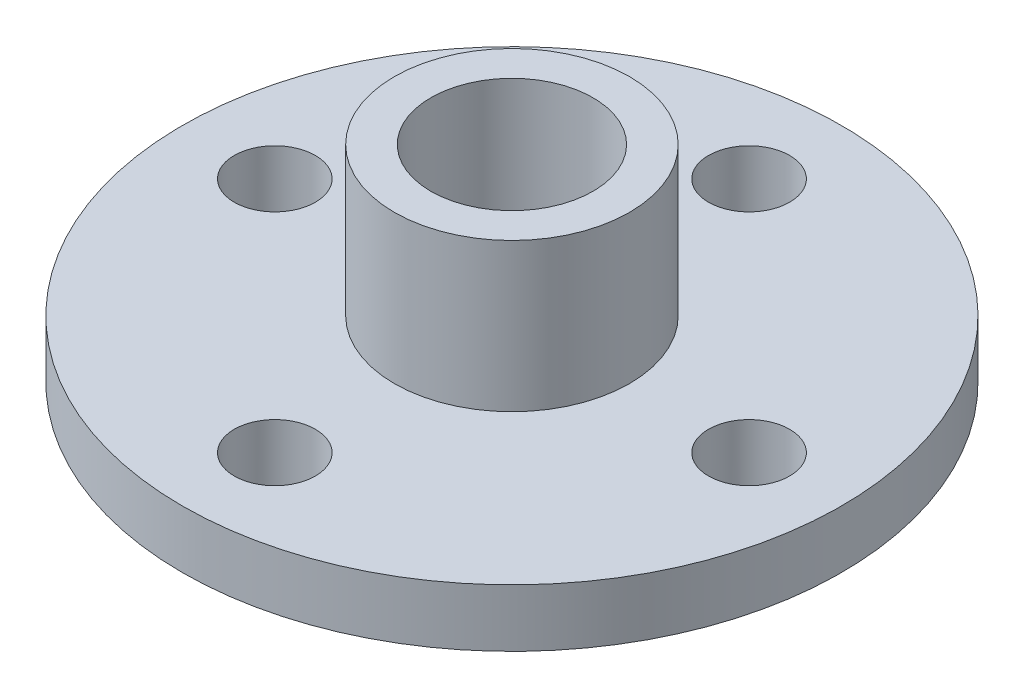
ISO-10303-21;
HEADER;
FILE_DESCRIPTION(('STEP AP214'),'2;1');
FILE_NAME('part.step','',(''),(''),'','','');
FILE_SCHEMA(('AUTOMOTIVE_DESIGN { 1 0 10303 214 1 1 1 1 }'));
ENDSEC;
DATA;
#1=APPLICATION_CONTEXT('core data for automotive mechanical design processes');
#2=APPLICATION_PROTOCOL_DEFINITION('international standard','automotive_design',2000,#1);
#3=PRODUCT_CONTEXT('',#1,'mechanical');
#4=PRODUCT('Part','Part','',(#3));
#5=PRODUCT_RELATED_PRODUCT_CATEGORY('part','',(#4));
#6=PRODUCT_DEFINITION_FORMATION('','',#4);
#7=PRODUCT_DEFINITION_CONTEXT('part definition',#1,'design');
#8=PRODUCT_DEFINITION('design','',#6,#7);
#9=PRODUCT_DEFINITION_SHAPE('','',#8);
#10=(LENGTH_UNIT() NAMED_UNIT(*) SI_UNIT(.MILLI.,.METRE.));
#11=(NAMED_UNIT(*) PLANE_ANGLE_UNIT() SI_UNIT($,.RADIAN.));
#12=(NAMED_UNIT(*) SI_UNIT($,.STERADIAN.) SOLID_ANGLE_UNIT());
#13=UNCERTAINTY_MEASURE_WITH_UNIT(LENGTH_MEASURE(1.E-05),#10,'distance_accuracy_value','');
#14=(GEOMETRIC_REPRESENTATION_CONTEXT(3) GLOBAL_UNCERTAINTY_ASSIGNED_CONTEXT((#13)) GLOBAL_UNIT_ASSIGNED_CONTEXT((#10,
#11,#12)) REPRESENTATION_CONTEXT('',''));
#15=CARTESIAN_POINT('',(0.,0.,0.));
#16=DIRECTION('',(0.,0.,1.));
#17=DIRECTION('',(1.,0.,0.));
#18=AXIS2_PLACEMENT_3D('',#15,#16,#17);
#19=CARTESIAN_POINT('',(0.,1.778,0.));
#20=DIRECTION('',(0.,1.,0.));
#21=DIRECTION('',(0.,0.,1.));
#22=AXIS2_PLACEMENT_3D('',#19,#20,#21);
#23=PLANE('',#22);
#24=CARTESIAN_POINT('',(0.,1.778,0.));
#25=DIRECTION('',(0.,1.,0.));
#26=DIRECTION('',(0.,0.,1.));
#27=AXIS2_PLACEMENT_3D('',#24,#25,#26);
#28=CIRCLE('',#27,1.625);
#29=CARTESIAN_POINT('',(0.,1.778,1.625));
#30=VERTEX_POINT('',#29);
#31=EDGE_CURVE('E62',#30,#30,#28,.T.);
#32=ORIENTED_EDGE('',*,*,#31,.F.);
#33=EDGE_LOOP('',(#32));
#34=FACE_BOUND('',#33,.T.);
#35=CARTESIAN_POINT('',(0.,1.778,0.));
#36=DIRECTION('',(0.,1.,0.));
#37=DIRECTION('',(0.,0.,1.));
#38=AXIS2_PLACEMENT_3D('',#35,#36,#37);
#39=CIRCLE('',#38,2.5);
#40=CARTESIAN_POINT('',(0.,1.778,2.5));
#41=VERTEX_POINT('',#40);
#42=EDGE_CURVE('E12',#41,#41,#39,.F.);
#43=ORIENTED_EDGE('',*,*,#42,.F.);
#44=EDGE_LOOP('',(#43));
#45=FACE_BOUND('',#44,.T.);
#46=ADVANCED_FACE('F46',(#34,#45),#23,.T.);
#47=CARTESIAN_POINT('',(-7.31,1.778,0.));
#48=DIRECTION('',(0.,1.,0.));
#49=DIRECTION('',(0.,0.,1.));
#50=AXIS2_PLACEMENT_3D('',#47,#48,#49);
#51=CIRCLE('',#50,1.25);
#52=CARTESIAN_POINT('',(-7.31,1.778,1.25));
#53=VERTEX_POINT('',#52);
#54=EDGE_CURVE('E78',#53,#53,#51,.T.);
#55=ORIENTED_EDGE('',*,*,#54,.F.);
#56=EDGE_LOOP('',(#55));
#57=FACE_BOUND('',#56,.T.);
#58=CARTESIAN_POINT('',(0.,1.778,7.31));
#59=DIRECTION('',(0.,1.,0.));
#60=DIRECTION('',(0.,0.,1.));
#61=AXIS2_PLACEMENT_3D('',#58,#59,#60);
#62=CIRCLE('',#61,1.25);
#63=CARTESIAN_POINT('',(0.,1.778,8.56));
#64=VERTEX_POINT('',#63);
#65=EDGE_CURVE('E81',#64,#64,#62,.T.);
#66=ORIENTED_EDGE('',*,*,#65,.F.);
#67=EDGE_LOOP('',(#66));
#68=FACE_BOUND('',#67,.T.);
#69=CARTESIAN_POINT('',(7.31,1.778,0.));
#70=DIRECTION('',(0.,1.,0.));
#71=DIRECTION('',(0.,0.,1.));
#72=AXIS2_PLACEMENT_3D('',#69,#70,#71);
#73=CIRCLE('',#72,1.25);
#74=CARTESIAN_POINT('',(7.31,1.778,1.25));
#75=VERTEX_POINT('',#74);
#76=EDGE_CURVE('E84',#75,#75,#73,.T.);
#77=ORIENTED_EDGE('',*,*,#76,.F.);
#78=EDGE_LOOP('',(#77));
#79=FACE_BOUND('',#78,.T.);
#80=CARTESIAN_POINT('',(0.,1.778,-7.31));
#81=DIRECTION('',(0.,1.,0.));
#82=DIRECTION('',(0.,0.,1.));
#83=AXIS2_PLACEMENT_3D('',#80,#81,#82);
#84=CIRCLE('',#83,1.25);
#85=CARTESIAN_POINT('',(0.,1.778,-6.06));
#86=VERTEX_POINT('',#85);
#87=EDGE_CURVE('E87',#86,#86,#84,.T.);
#88=ORIENTED_EDGE('',*,*,#87,.F.);
#89=EDGE_LOOP('',(#88));
#90=FACE_BOUND('',#89,.T.);
#91=CARTESIAN_POINT('',(0.,1.778,0.));
#92=DIRECTION('',(0.,1.,0.));
#93=DIRECTION('',(0.,0.,1.));
#94=AXIS2_PLACEMENT_3D('',#91,#92,#93);
#95=CIRCLE('',#94,3.625);
#96=CARTESIAN_POINT('',(0.,1.778,3.625));
#97=VERTEX_POINT('',#96);
#98=EDGE_CURVE('E70',#97,#97,#95,.T.);
#99=ORIENTED_EDGE('',*,*,#98,.F.);
#100=EDGE_LOOP('',(#99));
#101=FACE_BOUND('',#100,.T.);
#102=CARTESIAN_POINT('',(0.,1.778,0.));
#103=DIRECTION('',(0.,1.,0.));
#104=DIRECTION('',(0.,0.,1.));
#105=AXIS2_PLACEMENT_3D('',#102,#103,#104);
#106=CIRCLE('',#105,10.16);
#107=CARTESIAN_POINT('',(0.,1.778,10.16));
#108=VERTEX_POINT('',#107);
#109=EDGE_CURVE('E53',#108,#108,#106,.T.);
#110=ORIENTED_EDGE('',*,*,#109,.T.);
#111=EDGE_LOOP('',(#110));
#112=FACE_BOUND('',#111,.T.);
#113=ADVANCED_FACE('F108',(#57,#68,#79,#90,#101,#112),#23,.T.);
#114=CARTESIAN_POINT('',(0.,0.,0.));
#115=DIRECTION('',(0.,1.,0.));
#116=DIRECTION('',(0.,0.,1.));
#117=AXIS2_PLACEMENT_3D('',#114,#115,#116);
#118=PLANE('',#117);
#119=CARTESIAN_POINT('',(-7.31,0.,0.));
#120=DIRECTION('',(0.,-1.,0.));
#121=DIRECTION('',(0.,0.,-1.));
#122=AXIS2_PLACEMENT_3D('',#119,#120,#121);
#123=CIRCLE('',#122,1.25);
#124=CARTESIAN_POINT('',(-7.31,0.,-1.25));
#125=VERTEX_POINT('',#124);
#126=EDGE_CURVE('E90',#125,#125,#123,.T.);
#127=ORIENTED_EDGE('',*,*,#126,.F.);
#128=EDGE_LOOP('',(#127));
#129=FACE_BOUND('',#128,.T.);
#130=CARTESIAN_POINT('',(0.,0.,7.31));
#131=DIRECTION('',(0.,-1.,0.));
#132=DIRECTION('',(0.,0.,-1.));
#133=AXIS2_PLACEMENT_3D('',#130,#131,#132);
#134=CIRCLE('',#133,1.25);
#135=CARTESIAN_POINT('',(0.,0.,6.06));
#136=VERTEX_POINT('',#135);
#137=EDGE_CURVE('E97',#136,#136,#134,.T.);
#138=ORIENTED_EDGE('',*,*,#137,.F.);
#139=EDGE_LOOP('',(#138));
#140=FACE_BOUND('',#139,.T.);
#141=CARTESIAN_POINT('',(7.31,0.,0.));
#142=DIRECTION('',(0.,-1.,0.));
#143=DIRECTION('',(0.,0.,-1.));
#144=AXIS2_PLACEMENT_3D('',#141,#142,#143);
#145=CIRCLE('',#144,1.25);
#146=CARTESIAN_POINT('',(7.31,0.,-1.25));
#147=VERTEX_POINT('',#146);
#148=EDGE_CURVE('E94',#147,#147,#145,.T.);
#149=ORIENTED_EDGE('',*,*,#148,.F.);
#150=EDGE_LOOP('',(#149));
#151=FACE_BOUND('',#150,.T.);
#152=CARTESIAN_POINT('',(0.,0.,-7.31));
#153=DIRECTION('',(0.,-1.,0.));
#154=DIRECTION('',(0.,0.,-1.));
#155=AXIS2_PLACEMENT_3D('',#152,#153,#154);
#156=CIRCLE('',#155,1.25);
#157=CARTESIAN_POINT('',(0.,0.,-8.56));
#158=VERTEX_POINT('',#157);
#159=EDGE_CURVE('E91',#158,#158,#156,.T.);
#160=ORIENTED_EDGE('',*,*,#159,.F.);
#161=EDGE_LOOP('',(#160));
#162=FACE_BOUND('',#161,.T.);
#163=CARTESIAN_POINT('',(0.,0.,0.));
#164=DIRECTION('',(0.,1.,0.));
#165=DIRECTION('',(0.,0.,1.));
#166=AXIS2_PLACEMENT_3D('',#163,#164,#165);
#167=CIRCLE('',#166,10.16);
#168=CARTESIAN_POINT('',(0.,0.,10.16));
#169=VERTEX_POINT('',#168);
#170=EDGE_CURVE('E57',#169,#169,#167,.T.);
#171=ORIENTED_EDGE('',*,*,#170,.F.);
#172=EDGE_LOOP('',(#171));
#173=FACE_BOUND('',#172,.T.);
#174=CARTESIAN_POINT('',(0.,0.,0.));
#175=DIRECTION('',(0.,1.,0.));
#176=DIRECTION('',(0.,0.,1.));
#177=AXIS2_PLACEMENT_3D('',#174,#175,#176);
#178=CIRCLE('',#177,1.625);
#179=CARTESIAN_POINT('',(0.,0.,1.625));
#180=VERTEX_POINT('',#179);
#181=EDGE_CURVE('E64',#180,#180,#178,.T.);
#182=ORIENTED_EDGE('',*,*,#181,.T.);
#183=EDGE_LOOP('',(#182));
#184=FACE_BOUND('',#183,.T.);
#185=ADVANCED_FACE('F105',(#129,#140,#151,#162,#173,#184),#118,.F.);
#186=CARTESIAN_POINT('',(0.,1.778,0.));
#187=DIRECTION('',(0.,-1.,0.));
#188=DIRECTION('',(0.,0.,-1.));
#189=AXIS2_PLACEMENT_3D('',#186,#187,#188);
#190=CYLINDRICAL_SURFACE('',#189,10.16);
#191=ORIENTED_EDGE('',*,*,#109,.F.);
#192=EDGE_LOOP('',(#191));
#193=FACE_BOUND('',#192,.T.);
#194=ORIENTED_EDGE('',*,*,#170,.T.);
#195=EDGE_LOOP('',(#194));
#196=FACE_BOUND('',#195,.T.);
#197=ADVANCED_FACE('F48',(#193,#196),#190,.T.);
#198=CARTESIAN_POINT('',(0.,1.778,0.));
#199=DIRECTION('',(0.,-1.,0.));
#200=DIRECTION('',(0.,0.,-1.));
#201=AXIS2_PLACEMENT_3D('',#198,#199,#200);
#202=CYLINDRICAL_SURFACE('',#201,1.625);
#203=ORIENTED_EDGE('',*,*,#31,.T.);
#204=EDGE_LOOP('',(#203));
#205=FACE_BOUND('',#204,.T.);
#206=ORIENTED_EDGE('',*,*,#181,.F.);
#207=EDGE_LOOP('',(#206));
#208=FACE_BOUND('',#207,.T.);
#209=ADVANCED_FACE('F119',(#205,#208),#202,.F.);
#210=CARTESIAN_POINT('',(0.,6.35,0.));
#211=DIRECTION('',(0.,1.,0.));
#212=DIRECTION('',(0.,0.,1.));
#213=AXIS2_PLACEMENT_3D('',#210,#211,#212);
#214=PLANE('',#213);
#215=CARTESIAN_POINT('',(0.,6.35,0.));
#216=DIRECTION('',(0.,1.,0.));
#217=DIRECTION('',(0.,0.,1.));
#218=AXIS2_PLACEMENT_3D('',#215,#216,#217);
#219=CIRCLE('',#218,3.625);
#220=CARTESIAN_POINT('',(0.,6.35,3.625));
#221=VERTEX_POINT('',#220);
#222=EDGE_CURVE('E67',#221,#221,#219,.T.);
#223=ORIENTED_EDGE('',*,*,#222,.T.);
#224=EDGE_LOOP('',(#223));
#225=FACE_BOUND('',#224,.T.);
#226=CARTESIAN_POINT('',(0.,6.35,0.));
#227=DIRECTION('',(0.,1.,0.));
#228=DIRECTION('',(0.,0.,1.));
#229=AXIS2_PLACEMENT_3D('',#226,#227,#228);
#230=CIRCLE('',#229,2.5);
#231=CARTESIAN_POINT('',(0.,6.35,2.5));
#232=VERTEX_POINT('',#231);
#233=EDGE_CURVE('E73',#232,#232,#230,.T.);
#234=ORIENTED_EDGE('',*,*,#233,.F.);
#235=EDGE_LOOP('',(#234));
#236=FACE_BOUND('',#235,.T.);
#237=ADVANCED_FACE('F121',(#225,#236),#214,.T.);
#238=CARTESIAN_POINT('',(0.,6.35,0.));
#239=DIRECTION('',(0.,-1.,0.));
#240=DIRECTION('',(0.,0.,-1.));
#241=AXIS2_PLACEMENT_3D('',#238,#239,#240);
#242=CYLINDRICAL_SURFACE('',#241,3.625);
#243=ORIENTED_EDGE('',*,*,#222,.F.);
#244=EDGE_LOOP('',(#243));
#245=FACE_BOUND('',#244,.T.);
#246=ORIENTED_EDGE('',*,*,#98,.T.);
#247=EDGE_LOOP('',(#246));
#248=FACE_BOUND('',#247,.T.);
#249=ADVANCED_FACE('F128',(#245,#248),#242,.T.);
#250=CARTESIAN_POINT('',(0.,6.35,0.));
#251=DIRECTION('',(0.,-1.,0.));
#252=DIRECTION('',(0.,0.,-1.));
#253=AXIS2_PLACEMENT_3D('',#250,#251,#252);
#254=CYLINDRICAL_SURFACE('',#253,2.5);
#255=ORIENTED_EDGE('',*,*,#233,.T.);
#256=EDGE_LOOP('',(#255));
#257=FACE_BOUND('',#256,.T.);
#258=ORIENTED_EDGE('',*,*,#42,.T.);
#259=EDGE_LOOP('',(#258));
#260=FACE_BOUND('',#259,.T.);
#261=ADVANCED_FACE('F155',(#257,#260),#254,.F.);
#262=CARTESIAN_POINT('',(0.,6.35,-7.31));
#263=DIRECTION('',(0.,-1.,0.));
#264=DIRECTION('',(0.,0.,-1.));
#265=AXIS2_PLACEMENT_3D('',#262,#263,#264);
#266=CYLINDRICAL_SURFACE('',#265,1.25);
#267=ORIENTED_EDGE('',*,*,#87,.T.);
#268=EDGE_LOOP('',(#267));
#269=FACE_BOUND('',#268,.T.);
#270=ORIENTED_EDGE('',*,*,#159,.T.);
#271=EDGE_LOOP('',(#270));
#272=FACE_BOUND('',#271,.T.);
#273=ADVANCED_FACE('F160',(#269,#272),#266,.F.);
#274=CARTESIAN_POINT('',(7.31,6.35,0.));
#275=DIRECTION('',(0.,-1.,0.));
#276=DIRECTION('',(0.,0.,-1.));
#277=AXIS2_PLACEMENT_3D('',#274,#275,#276);
#278=CYLINDRICAL_SURFACE('',#277,1.25);
#279=ORIENTED_EDGE('',*,*,#76,.T.);
#280=EDGE_LOOP('',(#279));
#281=FACE_BOUND('',#280,.T.);
#282=ORIENTED_EDGE('',*,*,#148,.T.);
#283=EDGE_LOOP('',(#282));
#284=FACE_BOUND('',#283,.T.);
#285=ADVANCED_FACE('F167',(#281,#284),#278,.F.);
#286=CARTESIAN_POINT('',(0.,6.35,7.31));
#287=DIRECTION('',(0.,-1.,0.));
#288=DIRECTION('',(0.,0.,-1.));
#289=AXIS2_PLACEMENT_3D('',#286,#287,#288);
#290=CYLINDRICAL_SURFACE('',#289,1.25);
#291=ORIENTED_EDGE('',*,*,#65,.T.);
#292=EDGE_LOOP('',(#291));
#293=FACE_BOUND('',#292,.T.);
#294=ORIENTED_EDGE('',*,*,#137,.T.);
#295=EDGE_LOOP('',(#294));
#296=FACE_BOUND('',#295,.T.);
#297=ADVANCED_FACE('F171',(#293,#296),#290,.F.);
#298=CARTESIAN_POINT('',(-7.31,6.35,0.));
#299=DIRECTION('',(0.,-1.,0.));
#300=DIRECTION('',(0.,0.,-1.));
#301=AXIS2_PLACEMENT_3D('',#298,#299,#300);
#302=CYLINDRICAL_SURFACE('',#301,1.25);
#303=ORIENTED_EDGE('',*,*,#54,.T.);
#304=EDGE_LOOP('',(#303));
#305=FACE_BOUND('',#304,.T.);
#306=ORIENTED_EDGE('',*,*,#126,.T.);
#307=EDGE_LOOP('',(#306));
#308=FACE_BOUND('',#307,.T.);
#309=ADVANCED_FACE('F103',(#305,#308),#302,.F.);
#310=CLOSED_SHELL('',(#46,#113,#185,#197,#209,#237,#249,#261,#273,#285,#297,#309));
#311=MANIFOLD_SOLID_BREP('B2',#310);
#312=ADVANCED_BREP_SHAPE_REPRESENTATION('',(#18,#311),#14);
#313=SHAPE_DEFINITION_REPRESENTATION(#9,#312);
ENDSEC;
END-ISO-10303-21;
